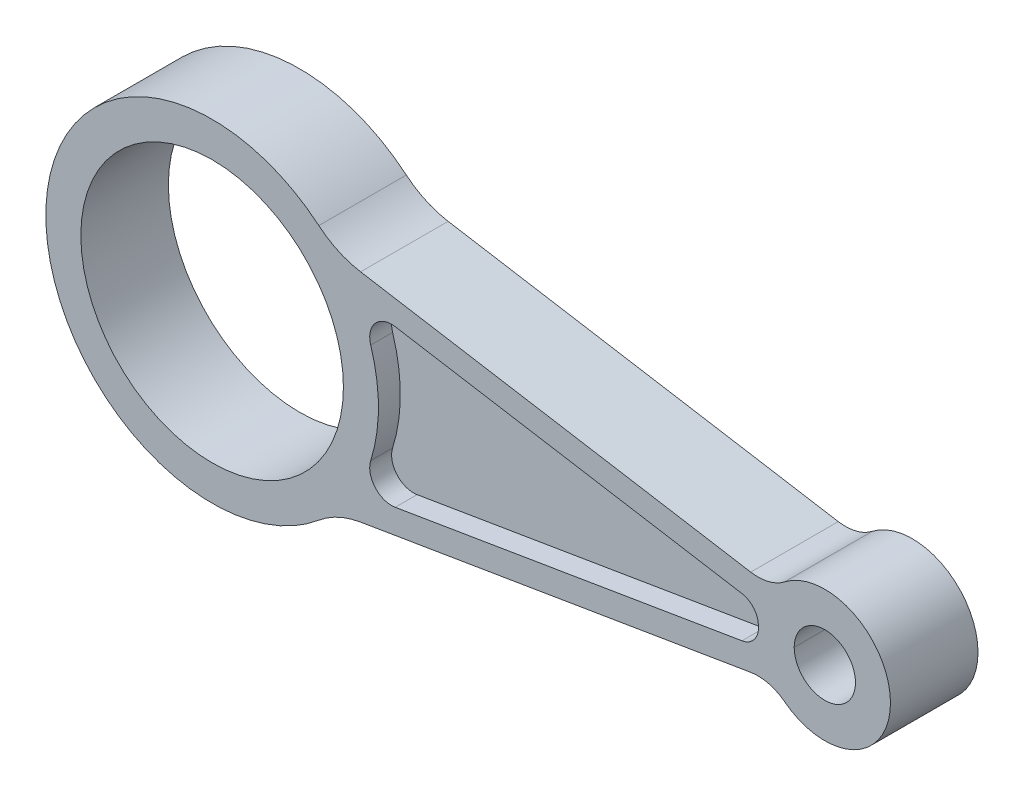
ISO-10303-21;
HEADER;
FILE_DESCRIPTION(('STEP AP214'),'2;1');
FILE_NAME('part.step','',(''),(''),'','','');
FILE_SCHEMA(('AUTOMOTIVE_DESIGN { 1 0 10303 214 1 1 1 1 }'));
ENDSEC;
DATA;
#1=APPLICATION_CONTEXT('core data for automotive mechanical design processes');
#2=APPLICATION_PROTOCOL_DEFINITION('international standard','automotive_design',2000,#1);
#3=PRODUCT_CONTEXT('',#1,'mechanical');
#4=PRODUCT('Part','Part','',(#3));
#5=PRODUCT_RELATED_PRODUCT_CATEGORY('part','',(#4));
#6=PRODUCT_DEFINITION_FORMATION('','',#4);
#7=PRODUCT_DEFINITION_CONTEXT('part definition',#1,'design');
#8=PRODUCT_DEFINITION('design','',#6,#7);
#9=PRODUCT_DEFINITION_SHAPE('','',#8);
#10=(LENGTH_UNIT() NAMED_UNIT(*) SI_UNIT(.MILLI.,.METRE.));
#11=(NAMED_UNIT(*) PLANE_ANGLE_UNIT() SI_UNIT($,.RADIAN.));
#12=(NAMED_UNIT(*) SI_UNIT($,.STERADIAN.) SOLID_ANGLE_UNIT());
#13=UNCERTAINTY_MEASURE_WITH_UNIT(LENGTH_MEASURE(1.E-05),#10,'distance_accuracy_value','');
#14=(GEOMETRIC_REPRESENTATION_CONTEXT(3) GLOBAL_UNCERTAINTY_ASSIGNED_CONTEXT((#13)) GLOBAL_UNIT_ASSIGNED_CONTEXT((#10,
#11,#12)) REPRESENTATION_CONTEXT('',''));
#15=CARTESIAN_POINT('',(0.,0.,0.));
#16=DIRECTION('',(0.,0.,1.));
#17=DIRECTION('',(1.,0.,0.));
#18=AXIS2_PLACEMENT_3D('',#15,#16,#17);
#19=CARTESIAN_POINT('',(140.,0.,-20.));
#20=DIRECTION('',(0.,0.,1.));
#21=DIRECTION('',(1.,0.,0.));
#22=AXIS2_PLACEMENT_3D('',#19,#20,#21);
#23=CYLINDRICAL_SURFACE('',#22,7.00000000000001);
#24=CARTESIAN_POINT('',(140.,0.,-20.));
#25=DIRECTION('',(0.,0.,1.));
#26=DIRECTION('',(1.,0.,0.));
#27=AXIS2_PLACEMENT_3D('',#24,#25,#26);
#28=CIRCLE('',#27,7.00000000000001);
#29=CARTESIAN_POINT('',(133.,0.,-20.));
#30=VERTEX_POINT('',#29);
#31=CARTESIAN_POINT('',(147.,0.,-20.));
#32=VERTEX_POINT('',#31);
#33=EDGE_CURVE('E328',#30,#32,#28,.T.);
#34=ORIENTED_EDGE('',*,*,#33,.F.);
#35=DIRECTION('',(0.,0.,1.));
#36=VECTOR('',#35,1.);
#37=CARTESIAN_POINT('',(133.,0.,-20.));
#38=LINE('',#37,#36);
#39=CARTESIAN_POINT('',(133.,0.,0.));
#40=VERTEX_POINT('',#39);
#41=EDGE_CURVE('E11',#30,#40,#38,.T.);
#42=ORIENTED_EDGE('',*,*,#41,.T.);
#43=CARTESIAN_POINT('',(140.,0.,0.));
#44=DIRECTION('',(0.,0.,1.));
#45=DIRECTION('',(1.,0.,0.));
#46=AXIS2_PLACEMENT_3D('',#43,#44,#45);
#47=CIRCLE('',#46,7.00000000000001);
#48=CARTESIAN_POINT('',(147.,0.,0.));
#49=VERTEX_POINT('',#48);
#50=EDGE_CURVE('E313',#40,#49,#47,.T.);
#51=ORIENTED_EDGE('',*,*,#50,.T.);
#52=DIRECTION('',(0.,0.,-1.));
#53=VECTOR('',#52,1.);
#54=CARTESIAN_POINT('',(147.,0.,-20.));
#55=LINE('',#54,#53);
#56=EDGE_CURVE('E51',#49,#32,#55,.T.);
#57=ORIENTED_EDGE('',*,*,#56,.T.);
#58=EDGE_LOOP('',(#34,#42,#51,#57));
#59=FACE_BOUND('',#58,.T.);
#60=ADVANCED_FACE('F42',(#59),#23,.F.);
#61=CARTESIAN_POINT('',(0.,0.,-20.));
#62=DIRECTION('',(0.,0.,1.));
#63=DIRECTION('',(1.,0.,0.));
#64=AXIS2_PLACEMENT_3D('',#61,#62,#63);
#65=CYLINDRICAL_SURFACE('',#64,38.);
#66=CARTESIAN_POINT('',(0.,0.,0.));
#67=DIRECTION('',(0.,0.,1.));
#68=DIRECTION('',(1.,0.,0.));
#69=AXIS2_PLACEMENT_3D('',#66,#67,#68);
#70=CIRCLE('',#69,38.);
#71=CARTESIAN_POINT('',(24.3781675337846,29.1496989297442,0.));
#72=VERTEX_POINT('',#71);
#73=CARTESIAN_POINT('',(24.3781675337846,-29.1496989297442,0.));
#74=VERTEX_POINT('',#73);
#75=EDGE_CURVE('E338',#72,#74,#70,.T.);
#76=ORIENTED_EDGE('',*,*,#75,.F.);
#77=DIRECTION('',(0.,0.,1.));
#78=VECTOR('',#77,1.);
#79=CARTESIAN_POINT('',(24.3781675337846,29.1496989297442,-20.));
#80=LINE('',#79,#78);
#81=CARTESIAN_POINT('',(24.3781675337846,29.1496989297442,-20.));
#82=VERTEX_POINT('',#81);
#83=EDGE_CURVE('E385',#72,#82,#80,.F.);
#84=ORIENTED_EDGE('',*,*,#83,.T.);
#85=CARTESIAN_POINT('',(0.,0.,-20.));
#86=DIRECTION('',(0.,0.,1.));
#87=DIRECTION('',(1.,0.,0.));
#88=AXIS2_PLACEMENT_3D('',#85,#86,#87);
#89=CIRCLE('',#88,38.);
#90=CARTESIAN_POINT('',(24.3781675337846,-29.1496989297442,-20.));
#91=VERTEX_POINT('',#90);
#92=EDGE_CURVE('E349',#82,#91,#89,.T.);
#93=ORIENTED_EDGE('',*,*,#92,.T.);
#94=DIRECTION('',(0.,0.,1.));
#95=VECTOR('',#94,1.);
#96=CARTESIAN_POINT('',(24.3781675337846,-29.1496989297442,-20.));
#97=LINE('',#96,#95);
#98=EDGE_CURVE('E382',#91,#74,#97,.T.);
#99=ORIENTED_EDGE('',*,*,#98,.T.);
#100=EDGE_LOOP('',(#76,#84,#93,#99));
#101=FACE_BOUND('',#100,.T.);
#102=ADVANCED_FACE('F44',(#101),#65,.T.);
#103=CARTESIAN_POINT('',(27.9354736759495,25.7606154914888,-20.));
#104=DIRECTION('',(0.164285714285714,0.986412795984335,0.));
#105=DIRECTION('',(-0.986412795984335,0.164285714285714,0.));
#106=AXIS2_PLACEMENT_3D('',#103,#104,#105);
#107=PLANE('',#106);
#108=DIRECTION('',(-0.986412795984335,0.164285714285714,0.));
#109=VECTOR('',#108,1.);
#110=CARTESIAN_POINT('',(27.9354736759495,25.7606154914888,-20.));
#111=LINE('',#110,#109);
#112=CARTESIAN_POINT('',(123.068754783715,9.91629645714704,-20.));
#113=VERTEX_POINT('',#112);
#114=CARTESIAN_POINT('',(33.9230677395358,24.7633898151861,-20.));
#115=VERTEX_POINT('',#114);
#116=EDGE_CURVE('E357',#113,#115,#111,.T.);
#117=ORIENTED_EDGE('',*,*,#116,.T.);
#118=DIRECTION('',(0.,0.,-1.));
#119=VECTOR('',#118,1.);
#120=CARTESIAN_POINT('',(33.9230677395358,24.7633898151861,0.));
#121=LINE('',#120,#119);
#122=CARTESIAN_POINT('',(33.9230677395358,24.7633898151861,0.));
#123=VERTEX_POINT('',#122);
#124=EDGE_CURVE('E379',#115,#123,#121,.F.);
#125=ORIENTED_EDGE('',*,*,#124,.T.);
#126=DIRECTION('',(-0.986412795984335,0.164285714285714,0.));
#127=VECTOR('',#126,1.);
#128=CARTESIAN_POINT('',(27.9354736759495,25.7606154914888,0.));
#129=LINE('',#128,#127);
#130=CARTESIAN_POINT('',(123.068754783715,9.91629645714704,0.));
#131=VERTEX_POINT('',#130);
#132=EDGE_CURVE('E346',#131,#123,#129,.T.);
#133=ORIENTED_EDGE('',*,*,#132,.F.);
#134=DIRECTION('',(0.,0.,-1.));
#135=VECTOR('',#134,1.);
#136=CARTESIAN_POINT('',(123.068754783715,9.91629645714704,-20.));
#137=LINE('',#136,#135);
#138=EDGE_CURVE('E365',#131,#113,#137,.T.);
#139=ORIENTED_EDGE('',*,*,#138,.T.);
#140=EDGE_LOOP('',(#117,#125,#133,#139));
#141=FACE_BOUND('',#140,.T.);
#142=ADVANCED_FACE('F423',(#141),#107,.T.);
#143=CARTESIAN_POINT('',(140.,0.,-20.));
#144=DIRECTION('',(0.,0.,1.));
#145=DIRECTION('',(1.,0.,0.));
#146=AXIS2_PLACEMENT_3D('',#143,#144,#145);
#147=CYLINDRICAL_SURFACE('',#146,15.);
#148=CARTESIAN_POINT('',(140.,0.,-20.));
#149=DIRECTION('',(0.,0.,1.));
#150=DIRECTION('',(1.,0.,0.));
#151=AXIS2_PLACEMENT_3D('',#148,#149,#150);
#152=CIRCLE('',#151,15.);
#153=CARTESIAN_POINT('',(130.826967155943,-11.8682546501942,-20.));
#154=VERTEX_POINT('',#153);
#155=CARTESIAN_POINT('',(130.826967155943,11.8682546501942,-20.));
#156=VERTEX_POINT('',#155);
#157=EDGE_CURVE('E354',#154,#156,#152,.T.);
#158=ORIENTED_EDGE('',*,*,#157,.T.);
#159=DIRECTION('',(0.,0.,1.));
#160=VECTOR('',#159,1.);
#161=CARTESIAN_POINT('',(130.826967155943,11.8682546501942,-20.));
#162=LINE('',#161,#160);
#163=CARTESIAN_POINT('',(130.826967155943,11.8682546501942,0.));
#164=VERTEX_POINT('',#163);
#165=EDGE_CURVE('E362',#156,#164,#162,.T.);
#166=ORIENTED_EDGE('',*,*,#165,.T.);
#167=CARTESIAN_POINT('',(140.,0.,0.));
#168=DIRECTION('',(0.,0.,1.));
#169=DIRECTION('',(1.,0.,0.));
#170=AXIS2_PLACEMENT_3D('',#167,#168,#169);
#171=CIRCLE('',#170,15.);
#172=CARTESIAN_POINT('',(130.826967155943,-11.8682546501942,0.));
#173=VERTEX_POINT('',#172);
#174=EDGE_CURVE('E343',#173,#164,#171,.T.);
#175=ORIENTED_EDGE('',*,*,#174,.F.);
#176=DIRECTION('',(0.,0.,1.));
#177=VECTOR('',#176,1.);
#178=CARTESIAN_POINT('',(130.826967155943,-11.8682546501942,-20.));
#179=LINE('',#178,#177);
#180=EDGE_CURVE('E360',#173,#154,#179,.F.);
#181=ORIENTED_EDGE('',*,*,#180,.T.);
#182=EDGE_LOOP('',(#158,#166,#175,#181));
#183=FACE_BOUND('',#182,.T.);
#184=ADVANCED_FACE('F433',(#183),#147,.T.);
#185=CARTESIAN_POINT('',(27.9354736759495,-25.7606154914888,-20.));
#186=DIRECTION('',(0.164285714285714,-0.986412795984335,0.));
#187=DIRECTION('',(0.986412795984335,0.164285714285714,0.));
#188=AXIS2_PLACEMENT_3D('',#185,#186,#187);
#189=PLANE('',#188);
#190=DIRECTION('',(0.986412795984335,0.164285714285714,0.));
#191=VECTOR('',#190,1.);
#192=CARTESIAN_POINT('',(27.9354736759495,-25.7606154914888,0.));
#193=LINE('',#192,#191);
#194=CARTESIAN_POINT('',(33.9230677395358,-24.7633898151861,0.));
#195=VERTEX_POINT('',#194);
#196=CARTESIAN_POINT('',(123.068754783715,-9.91629645714704,0.));
#197=VERTEX_POINT('',#196);
#198=EDGE_CURVE('E341',#195,#197,#193,.T.);
#199=ORIENTED_EDGE('',*,*,#198,.F.);
#200=DIRECTION('',(0.,0.,-1.));
#201=VECTOR('',#200,1.);
#202=CARTESIAN_POINT('',(33.9230677395358,-24.7633898151861,-20.));
#203=LINE('',#202,#201);
#204=CARTESIAN_POINT('',(33.9230677395358,-24.7633898151861,-20.));
#205=VERTEX_POINT('',#204);
#206=EDGE_CURVE('E387',#195,#205,#203,.T.);
#207=ORIENTED_EDGE('',*,*,#206,.T.);
#208=DIRECTION('',(0.986412795984335,0.164285714285714,0.));
#209=VECTOR('',#208,1.);
#210=CARTESIAN_POINT('',(27.9354736759495,-25.7606154914888,-20.));
#211=LINE('',#210,#209);
#212=CARTESIAN_POINT('',(123.068754783715,-9.91629645714704,-20.));
#213=VERTEX_POINT('',#212);
#214=EDGE_CURVE('E352',#205,#213,#211,.T.);
#215=ORIENTED_EDGE('',*,*,#214,.T.);
#216=DIRECTION('',(0.,0.,-1.));
#217=VECTOR('',#216,1.);
#218=CARTESIAN_POINT('',(123.068754783715,-9.91629645714704,0.));
#219=LINE('',#218,#217);
#220=EDGE_CURVE('E367',#213,#197,#219,.F.);
#221=ORIENTED_EDGE('',*,*,#220,.T.);
#222=EDGE_LOOP('',(#199,#207,#215,#221));
#223=FACE_BOUND('',#222,.T.);
#224=ADVANCED_FACE('F406',(#223),#189,.T.);
#225=CARTESIAN_POINT('',(0.,0.,-20.));
#226=DIRECTION('',(0.,0.,1.));
#227=DIRECTION('',(1.,0.,0.));
#228=AXIS2_PLACEMENT_3D('',#225,#226,#227);
#229=PLANE('',#228);
#230=DIRECTION('',(0.986412795984335,-0.164285714285714,0.));
#231=VECTOR('',#230,1.);
#232=CARTESIAN_POINT('',(121.445609230919,4.61087017438385,-20.));
#233=LINE('',#232,#231);
#234=CARTESIAN_POINT('',(41.8285545583335,17.8709827250915,-20.));
#235=VERTEX_POINT('',#234);
#236=CARTESIAN_POINT('',(121.445609230919,4.61087017438385,-20.));
#237=VERTEX_POINT('',#236);
#238=EDGE_CURVE('E217',#235,#237,#233,.T.);
#239=ORIENTED_EDGE('',*,*,#238,.F.);
#240=CARTESIAN_POINT('',(41.0071259869049,12.9389187451698,-20.));
#241=DIRECTION('',(0.,0.,-1.));
#242=DIRECTION('',(1.,0.,0.));
#243=AXIS2_PLACEMENT_3D('',#240,#241,#242);
#244=CIRCLE('',#243,5.);
#245=CARTESIAN_POINT('',(36.2388555233113,11.4343933096849,-20.));
#246=VERTEX_POINT('',#245);
#247=EDGE_CURVE('E221',#246,#235,#244,.T.);
#248=ORIENTED_EDGE('',*,*,#247,.F.);
#249=CARTESIAN_POINT('',(0.,0.,-20.));
#250=DIRECTION('',(0.,0.,1.));
#251=DIRECTION('',(-1.,0.,0.));
#252=AXIS2_PLACEMENT_3D('',#249,#250,#251);
#253=CIRCLE('',#252,38.);
#254=CARTESIAN_POINT('',(36.2388555233113,-11.4343933096849,-20.));
#255=VERTEX_POINT('',#254);
#256=EDGE_CURVE('E238',#255,#246,#253,.T.);
#257=ORIENTED_EDGE('',*,*,#256,.F.);
#258=CARTESIAN_POINT('',(41.0071259869049,-12.9389187451698,-20.));
#259=DIRECTION('',(0.,0.,-1.));
#260=DIRECTION('',(-1.,0.,0.));
#261=AXIS2_PLACEMENT_3D('',#258,#259,#260);
#262=CIRCLE('',#261,5.);
#263=CARTESIAN_POINT('',(41.8285545583335,-17.8709827250915,-20.));
#264=VERTEX_POINT('',#263);
#265=EDGE_CURVE('E235',#264,#255,#262,.T.);
#266=ORIENTED_EDGE('',*,*,#265,.F.);
#267=DIRECTION('',(-0.986412795984335,-0.164285714285714,0.));
#268=VECTOR('',#267,1.);
#269=CARTESIAN_POINT('',(121.433526351168,-4.61288256163042,-20.));
#270=LINE('',#269,#268);
#271=CARTESIAN_POINT('',(121.433526351168,-4.61288256163042,-20.));
#272=VERTEX_POINT('',#271);
#273=EDGE_CURVE('E229',#272,#264,#270,.T.);
#274=ORIENTED_EDGE('',*,*,#273,.F.);
#275=CARTESIAN_POINT('',(120.694240636883,-0.174024979700915,-20.));
#276=DIRECTION('',(0.,0.,-1.));
#277=DIRECTION('',(-1.,0.,0.));
#278=AXIS2_PLACEMENT_3D('',#275,#276,#277);
#279=CIRCLE('',#278,4.5);
#280=CARTESIAN_POINT('',(125.194211833788,-0.157924451151643,-20.));
#281=VERTEX_POINT('',#280);
#282=EDGE_CURVE('E227',#281,#272,#279,.T.);
#283=ORIENTED_EDGE('',*,*,#282,.F.);
#284=CARTESIAN_POINT('',(120.706323516633,0.172012592454348,-20.));
#285=DIRECTION('',(0.,0.,-1.));
#286=DIRECTION('',(1.,0.,0.));
#287=AXIS2_PLACEMENT_3D('',#284,#285,#286);
#288=CIRCLE('',#287,4.5);
#289=EDGE_CURVE('E205',#237,#281,#288,.T.);
#290=ORIENTED_EDGE('',*,*,#289,.F.);
#291=EDGE_LOOP('',(#239,#248,#257,#266,#274,#283,#290));
#292=FACE_BOUND('',#291,.T.);
#293=EDGE_CURVE('E329',#32,#30,#28,.T.);
#294=ORIENTED_EDGE('',*,*,#293,.T.);
#295=ORIENTED_EDGE('',*,*,#33,.T.);
#296=EDGE_LOOP('',(#294,#295));
#297=FACE_BOUND('',#296,.T.);
#298=CARTESIAN_POINT('',(0.,0.,-20.));
#299=DIRECTION('',(0.,0.,1.));
#300=DIRECTION('',(1.,0.,0.));
#301=AXIS2_PLACEMENT_3D('',#298,#299,#300);
#302=CIRCLE('',#301,30.);
#303=CARTESIAN_POINT('',(30.,0.,-20.));
#304=VERTEX_POINT('',#303);
#305=EDGE_CURVE('E335',#304,#304,#302,.T.);
#306=ORIENTED_EDGE('',*,*,#305,.T.);
#307=EDGE_LOOP('',(#306));
#308=FACE_BOUND('',#307,.T.);
#309=ORIENTED_EDGE('',*,*,#92,.F.);
#310=CARTESIAN_POINT('',(37.2087820252501,44.4916457348728,-20.));
#311=DIRECTION('',(0.,0.,1.));
#312=DIRECTION('',(1.,0.,0.));
#313=AXIS2_PLACEMENT_3D('',#310,#311,#312);
#314=CIRCLE('',#313,20.);
#315=EDGE_CURVE('E391',#82,#115,#314,.T.);
#316=ORIENTED_EDGE('',*,*,#315,.T.);
#317=ORIENTED_EDGE('',*,*,#116,.F.);
#318=CARTESIAN_POINT('',(124.711611926572,19.7804244169904,-20.));
#319=DIRECTION('',(0.,0.,1.));
#320=DIRECTION('',(1.,0.,0.));
#321=AXIS2_PLACEMENT_3D('',#318,#319,#320);
#322=CIRCLE('',#321,10.);
#323=EDGE_CURVE('E372',#113,#156,#322,.T.);
#324=ORIENTED_EDGE('',*,*,#323,.T.);
#325=ORIENTED_EDGE('',*,*,#157,.F.);
#326=CARTESIAN_POINT('',(124.711611926572,-19.7804244169904,-20.));
#327=DIRECTION('',(0.,0.,1.));
#328=DIRECTION('',(1.,0.,0.));
#329=AXIS2_PLACEMENT_3D('',#326,#327,#328);
#330=CIRCLE('',#329,10.);
#331=EDGE_CURVE('E376',#154,#213,#330,.T.);
#332=ORIENTED_EDGE('',*,*,#331,.T.);
#333=ORIENTED_EDGE('',*,*,#214,.F.);
#334=CARTESIAN_POINT('',(37.2087820252501,-44.4916457348728,-20.));
#335=DIRECTION('',(0.,0.,1.));
#336=DIRECTION('',(1.,0.,0.));
#337=AXIS2_PLACEMENT_3D('',#334,#335,#336);
#338=CIRCLE('',#337,20.);
#339=EDGE_CURVE('E395',#205,#91,#338,.T.);
#340=ORIENTED_EDGE('',*,*,#339,.T.);
#341=EDGE_LOOP('',(#309,#316,#317,#324,#325,#332,#333,#340));
#342=FACE_BOUND('',#341,.T.);
#343=ADVANCED_FACE('F223',(#292,#297,#308,#342),#229,.F.);
#344=CARTESIAN_POINT('',(0.,0.,0.));
#345=DIRECTION('',(0.,0.,1.));
#346=DIRECTION('',(1.,0.,0.));
#347=AXIS2_PLACEMENT_3D('',#344,#345,#346);
#348=PLANE('',#347);
#349=CARTESIAN_POINT('',(41.0071259869049,12.9389187451698,0.));
#350=DIRECTION('',(0.,0.,1.));
#351=DIRECTION('',(-1.,0.,0.));
#352=AXIS2_PLACEMENT_3D('',#349,#350,#351);
#353=CIRCLE('',#352,5.);
#354=CARTESIAN_POINT('',(41.8285545583335,17.8709827250915,0.));
#355=VERTEX_POINT('',#354);
#356=CARTESIAN_POINT('',(36.2388555233113,11.4343933096849,0.));
#357=VERTEX_POINT('',#356);
#358=EDGE_CURVE('E261',#355,#357,#353,.T.);
#359=ORIENTED_EDGE('',*,*,#358,.F.);
#360=DIRECTION('',(-0.986412795984335,0.164285714285714,0.));
#361=VECTOR('',#360,1.);
#362=CARTESIAN_POINT('',(41.8285545583335,17.8709827250915,0.));
#363=LINE('',#362,#361);
#364=CARTESIAN_POINT('',(121.046940727538,4.67726787330641,0.));
#365=VERTEX_POINT('',#364);
#366=EDGE_CURVE('E286',#365,#355,#363,.T.);
#367=ORIENTED_EDGE('',*,*,#366,.F.);
#368=CARTESIAN_POINT('',(120.307655013253,0.238410291376902,0.));
#369=DIRECTION('',(0.,0.,1.));
#370=DIRECTION('',(1.,0.,0.));
#371=AXIS2_PLACEMENT_3D('',#368,#369,#370);
#372=CIRCLE('',#371,4.5);
#373=CARTESIAN_POINT('',(124.807655013251,0.238406077182834,0.));
#374=VERTEX_POINT('',#373);
#375=EDGE_CURVE('E283',#374,#365,#372,.T.);
#376=ORIENTED_EDGE('',*,*,#375,.F.);
#377=CARTESIAN_POINT('',(120.332548017383,-0.234264395276501,0.));
#378=DIRECTION('',(0.,0.,1.));
#379=DIRECTION('',(-1.,0.,0.));
#380=AXIS2_PLACEMENT_3D('',#377,#378,#379);
#381=CIRCLE('',#380,4.5);
#382=CARTESIAN_POINT('',(121.071833731668,-4.67312197720601,0.));
#383=VERTEX_POINT('',#382);
#384=EDGE_CURVE('E280',#383,#374,#381,.T.);
#385=ORIENTED_EDGE('',*,*,#384,.F.);
#386=DIRECTION('',(0.986412795984335,0.164285714285714,0.));
#387=VECTOR('',#386,1.);
#388=CARTESIAN_POINT('',(41.8285545583335,-17.8709827250915,0.));
#389=LINE('',#388,#387);
#390=CARTESIAN_POINT('',(41.8285545583335,-17.8709827250915,0.));
#391=VERTEX_POINT('',#390);
#392=EDGE_CURVE('E277',#391,#383,#389,.T.);
#393=ORIENTED_EDGE('',*,*,#392,.F.);
#394=CARTESIAN_POINT('',(41.0071259869049,-12.9389187451698,0.));
#395=DIRECTION('',(0.,0.,1.));
#396=DIRECTION('',(-1.,0.,0.));
#397=AXIS2_PLACEMENT_3D('',#394,#395,#396);
#398=CIRCLE('',#397,5.);
#399=CARTESIAN_POINT('',(36.2388555233113,-11.4343933096849,0.));
#400=VERTEX_POINT('',#399);
#401=EDGE_CURVE('E274',#400,#391,#398,.T.);
#402=ORIENTED_EDGE('',*,*,#401,.F.);
#403=CARTESIAN_POINT('',(0.,0.,0.));
#404=DIRECTION('',(0.,0.,-1.));
#405=DIRECTION('',(1.,0.,0.));
#406=AXIS2_PLACEMENT_3D('',#403,#404,#405);
#407=CIRCLE('',#406,38.);
#408=EDGE_CURVE('E271',#357,#400,#407,.T.);
#409=ORIENTED_EDGE('',*,*,#408,.F.);
#410=EDGE_LOOP('',(#359,#367,#376,#385,#393,#402,#409));
#411=FACE_BOUND('',#410,.T.);
#412=EDGE_CURVE('E326',#49,#40,#47,.T.);
#413=ORIENTED_EDGE('',*,*,#412,.F.);
#414=ORIENTED_EDGE('',*,*,#50,.F.);
#415=EDGE_LOOP('',(#413,#414));
#416=FACE_BOUND('',#415,.T.);
#417=CARTESIAN_POINT('',(0.,0.,0.));
#418=DIRECTION('',(0.,0.,1.));
#419=DIRECTION('',(1.,0.,0.));
#420=AXIS2_PLACEMENT_3D('',#417,#418,#419);
#421=CIRCLE('',#420,30.);
#422=CARTESIAN_POINT('',(30.,0.,0.));
#423=VERTEX_POINT('',#422);
#424=EDGE_CURVE('E332',#423,#423,#421,.T.);
#425=ORIENTED_EDGE('',*,*,#424,.F.);
#426=EDGE_LOOP('',(#425));
#427=FACE_BOUND('',#426,.T.);
#428=ORIENTED_EDGE('',*,*,#132,.T.);
#429=CARTESIAN_POINT('',(37.2087820252501,44.4916457348728,0.));
#430=DIRECTION('',(0.,0.,1.));
#431=DIRECTION('',(1.,0.,0.));
#432=AXIS2_PLACEMENT_3D('',#429,#430,#431);
#433=CIRCLE('',#432,20.);
#434=EDGE_CURVE('E389',#123,#72,#433,.F.);
#435=ORIENTED_EDGE('',*,*,#434,.T.);
#436=ORIENTED_EDGE('',*,*,#75,.T.);
#437=CARTESIAN_POINT('',(37.2087820252501,-44.4916457348728,0.));
#438=DIRECTION('',(0.,0.,1.));
#439=DIRECTION('',(1.,0.,0.));
#440=AXIS2_PLACEMENT_3D('',#437,#438,#439);
#441=CIRCLE('',#440,20.);
#442=EDGE_CURVE('E393',#74,#195,#441,.F.);
#443=ORIENTED_EDGE('',*,*,#442,.T.);
#444=ORIENTED_EDGE('',*,*,#198,.T.);
#445=CARTESIAN_POINT('',(124.711611926572,-19.7804244169904,0.));
#446=DIRECTION('',(0.,0.,1.));
#447=DIRECTION('',(1.,0.,0.));
#448=AXIS2_PLACEMENT_3D('',#445,#446,#447);
#449=CIRCLE('',#448,10.);
#450=EDGE_CURVE('E374',#197,#173,#449,.F.);
#451=ORIENTED_EDGE('',*,*,#450,.T.);
#452=ORIENTED_EDGE('',*,*,#174,.T.);
#453=CARTESIAN_POINT('',(124.711611926572,19.7804244169904,0.));
#454=DIRECTION('',(0.,0.,1.));
#455=DIRECTION('',(1.,0.,0.));
#456=AXIS2_PLACEMENT_3D('',#453,#454,#455);
#457=CIRCLE('',#456,10.);
#458=EDGE_CURVE('E370',#164,#131,#457,.F.);
#459=ORIENTED_EDGE('',*,*,#458,.T.);
#460=EDGE_LOOP('',(#428,#435,#436,#443,#444,#451,#452,#459));
#461=FACE_BOUND('',#460,.T.);
#462=ADVANCED_FACE('F405',(#411,#416,#427,#461),#348,.T.);
#463=CARTESIAN_POINT('',(0.,0.,-20.));
#464=DIRECTION('',(0.,0.,1.));
#465=DIRECTION('',(1.,0.,0.));
#466=AXIS2_PLACEMENT_3D('',#463,#464,#465);
#467=CYLINDRICAL_SURFACE('',#466,30.);
#468=ORIENTED_EDGE('',*,*,#305,.F.);
#469=EDGE_LOOP('',(#468));
#470=FACE_BOUND('',#469,.T.);
#471=ORIENTED_EDGE('',*,*,#424,.T.);
#472=EDGE_LOOP('',(#471));
#473=FACE_BOUND('',#472,.T.);
#474=ADVANCED_FACE('F458',(#470,#473),#467,.F.);
#475=ORIENTED_EDGE('',*,*,#41,.F.);
#476=ORIENTED_EDGE('',*,*,#293,.F.);
#477=ORIENTED_EDGE('',*,*,#56,.F.);
#478=ORIENTED_EDGE('',*,*,#412,.T.);
#479=EDGE_LOOP('',(#475,#476,#477,#478));
#480=FACE_BOUND('',#479,.T.);
#481=ADVANCED_FACE('F402',(#480),#23,.F.);
#482=CARTESIAN_POINT('',(124.711611926572,19.7804244169904,-20.));
#483=DIRECTION('',(0.,0.,1.));
#484=DIRECTION('',(1.,0.,0.));
#485=AXIS2_PLACEMENT_3D('',#482,#483,#484);
#486=CYLINDRICAL_SURFACE('',#485,10.);
#487=ORIENTED_EDGE('',*,*,#323,.F.);
#488=ORIENTED_EDGE('',*,*,#138,.F.);
#489=ORIENTED_EDGE('',*,*,#458,.F.);
#490=ORIENTED_EDGE('',*,*,#165,.F.);
#491=EDGE_LOOP('',(#487,#488,#489,#490));
#492=FACE_BOUND('',#491,.T.);
#493=ADVANCED_FACE('F431',(#492),#486,.F.);
#494=CARTESIAN_POINT('',(124.711611926572,-19.7804244169904,-20.));
#495=DIRECTION('',(0.,0.,1.));
#496=DIRECTION('',(1.,0.,0.));
#497=AXIS2_PLACEMENT_3D('',#494,#495,#496);
#498=CYLINDRICAL_SURFACE('',#497,10.);
#499=ORIENTED_EDGE('',*,*,#331,.F.);
#500=ORIENTED_EDGE('',*,*,#180,.F.);
#501=ORIENTED_EDGE('',*,*,#450,.F.);
#502=ORIENTED_EDGE('',*,*,#220,.F.);
#503=EDGE_LOOP('',(#499,#500,#501,#502));
#504=FACE_BOUND('',#503,.T.);
#505=ADVANCED_FACE('F439',(#504),#498,.F.);
#506=CARTESIAN_POINT('',(37.2087820252501,44.4916457348728,-20.));
#507=DIRECTION('',(0.,0.,1.));
#508=DIRECTION('',(1.,0.,0.));
#509=AXIS2_PLACEMENT_3D('',#506,#507,#508);
#510=CYLINDRICAL_SURFACE('',#509,20.);
#511=ORIENTED_EDGE('',*,*,#315,.F.);
#512=ORIENTED_EDGE('',*,*,#83,.F.);
#513=ORIENTED_EDGE('',*,*,#434,.F.);
#514=ORIENTED_EDGE('',*,*,#124,.F.);
#515=EDGE_LOOP('',(#511,#512,#513,#514));
#516=FACE_BOUND('',#515,.T.);
#517=ADVANCED_FACE('F420',(#516),#510,.F.);
#518=CARTESIAN_POINT('',(37.2087820252501,-44.4916457348728,-20.));
#519=DIRECTION('',(0.,0.,1.));
#520=DIRECTION('',(1.,0.,0.));
#521=AXIS2_PLACEMENT_3D('',#518,#519,#520);
#522=CYLINDRICAL_SURFACE('',#521,20.);
#523=ORIENTED_EDGE('',*,*,#339,.F.);
#524=ORIENTED_EDGE('',*,*,#206,.F.);
#525=ORIENTED_EDGE('',*,*,#442,.F.);
#526=ORIENTED_EDGE('',*,*,#98,.F.);
#527=EDGE_LOOP('',(#523,#524,#525,#526));
#528=FACE_BOUND('',#527,.T.);
#529=ADVANCED_FACE('F445',(#528),#522,.F.);
#530=CARTESIAN_POINT('',(41.0071259869049,12.9389187451698,-5.));
#531=DIRECTION('',(0.,0.,1.));
#532=DIRECTION('',(1.,0.,0.));
#533=AXIS2_PLACEMENT_3D('',#530,#531,#532);
#534=CYLINDRICAL_SURFACE('',#533,5.);
#535=ORIENTED_EDGE('',*,*,#358,.T.);
#536=DIRECTION('',(0.,0.,1.));
#537=VECTOR('',#536,1.);
#538=CARTESIAN_POINT('',(36.2388555233113,11.4343933096849,-5.));
#539=LINE('',#538,#537);
#540=CARTESIAN_POINT('',(36.2388555233113,11.4343933096849,-5.));
#541=VERTEX_POINT('',#540);
#542=EDGE_CURVE('E310',#541,#357,#539,.T.);
#543=ORIENTED_EDGE('',*,*,#542,.F.);
#544=CARTESIAN_POINT('',(41.0071259869049,12.9389187451698,-5.));
#545=DIRECTION('',(0.,0.,1.));
#546=DIRECTION('',(-1.,0.,0.));
#547=AXIS2_PLACEMENT_3D('',#544,#545,#546);
#548=CIRCLE('',#547,5.);
#549=CARTESIAN_POINT('',(41.8285545583335,17.8709827250915,-5.));
#550=VERTEX_POINT('',#549);
#551=EDGE_CURVE('E289',#550,#541,#548,.T.);
#552=ORIENTED_EDGE('',*,*,#551,.F.);
#553=DIRECTION('',(0.,0.,1.));
#554=VECTOR('',#553,1.);
#555=CARTESIAN_POINT('',(41.8285545583335,17.8709827250915,-5.));
#556=LINE('',#555,#554);
#557=EDGE_CURVE('E311',#550,#355,#556,.T.);
#558=ORIENTED_EDGE('',*,*,#557,.T.);
#559=EDGE_LOOP('',(#535,#543,#552,#558));
#560=FACE_BOUND('',#559,.T.);
#561=ADVANCED_FACE('F526',(#560),#534,.F.);
#562=CARTESIAN_POINT('',(41.8285545583335,17.8709827250915,-5.));
#563=DIRECTION('',(0.164285714285714,0.986412795984335,0.));
#564=DIRECTION('',(-0.986412795984335,0.164285714285714,0.));
#565=AXIS2_PLACEMENT_3D('',#562,#563,#564);
#566=PLANE('',#565);
#567=ORIENTED_EDGE('',*,*,#366,.T.);
#568=ORIENTED_EDGE('',*,*,#557,.F.);
#569=DIRECTION('',(-0.986412795984335,0.164285714285714,0.));
#570=VECTOR('',#569,1.);
#571=CARTESIAN_POINT('',(41.8285545583335,17.8709827250915,-5.));
#572=LINE('',#571,#570);
#573=CARTESIAN_POINT('',(121.046940727538,4.67726787330641,-5.));
#574=VERTEX_POINT('',#573);
#575=EDGE_CURVE('E307',#574,#550,#572,.T.);
#576=ORIENTED_EDGE('',*,*,#575,.F.);
#577=DIRECTION('',(0.,0.,1.));
#578=VECTOR('',#577,1.);
#579=CARTESIAN_POINT('',(121.046940727538,4.67726787330641,-5.));
#580=LINE('',#579,#578);
#581=EDGE_CURVE('E314',#574,#365,#580,.T.);
#582=ORIENTED_EDGE('',*,*,#581,.T.);
#583=EDGE_LOOP('',(#567,#568,#576,#582));
#584=FACE_BOUND('',#583,.T.);
#585=ADVANCED_FACE('F535',(#584),#566,.F.);
#586=CARTESIAN_POINT('',(120.307655013253,0.238410291376902,-5.));
#587=DIRECTION('',(0.,0.,1.));
#588=DIRECTION('',(1.,0.,0.));
#589=AXIS2_PLACEMENT_3D('',#586,#587,#588);
#590=CYLINDRICAL_SURFACE('',#589,4.5);
#591=ORIENTED_EDGE('',*,*,#375,.T.);
#592=ORIENTED_EDGE('',*,*,#581,.F.);
#593=CARTESIAN_POINT('',(120.307655013253,0.238410291376902,-5.));
#594=DIRECTION('',(0.,0.,1.));
#595=DIRECTION('',(1.,0.,0.));
#596=AXIS2_PLACEMENT_3D('',#593,#594,#595);
#597=CIRCLE('',#596,4.5);
#598=CARTESIAN_POINT('',(124.807655013251,0.238406077182834,-5.));
#599=VERTEX_POINT('',#598);
#600=EDGE_CURVE('E304',#599,#574,#597,.T.);
#601=ORIENTED_EDGE('',*,*,#600,.F.);
#602=DIRECTION('',(0.,0.,1.));
#603=VECTOR('',#602,1.);
#604=CARTESIAN_POINT('',(124.807655013251,0.238406077182834,-5.));
#605=LINE('',#604,#603);
#606=EDGE_CURVE('E316',#599,#374,#605,.T.);
#607=ORIENTED_EDGE('',*,*,#606,.T.);
#608=EDGE_LOOP('',(#591,#592,#601,#607));
#609=FACE_BOUND('',#608,.T.);
#610=ADVANCED_FACE('F545',(#609),#590,.F.);
#611=CARTESIAN_POINT('',(120.332548017383,-0.234264395276501,-5.));
#612=DIRECTION('',(0.,0.,1.));
#613=DIRECTION('',(1.,0.,0.));
#614=AXIS2_PLACEMENT_3D('',#611,#612,#613);
#615=CYLINDRICAL_SURFACE('',#614,4.5);
#616=ORIENTED_EDGE('',*,*,#384,.T.);
#617=ORIENTED_EDGE('',*,*,#606,.F.);
#618=CARTESIAN_POINT('',(120.332548017383,-0.234264395276501,-5.));
#619=DIRECTION('',(0.,0.,1.));
#620=DIRECTION('',(-1.,0.,0.));
#621=AXIS2_PLACEMENT_3D('',#618,#619,#620);
#622=CIRCLE('',#621,4.5);
#623=CARTESIAN_POINT('',(121.071833731668,-4.67312197720601,-5.));
#624=VERTEX_POINT('',#623);
#625=EDGE_CURVE('E301',#624,#599,#622,.T.);
#626=ORIENTED_EDGE('',*,*,#625,.F.);
#627=DIRECTION('',(0.,0.,1.));
#628=VECTOR('',#627,1.);
#629=CARTESIAN_POINT('',(121.071833731668,-4.67312197720601,-5.));
#630=LINE('',#629,#628);
#631=EDGE_CURVE('E318',#624,#383,#630,.T.);
#632=ORIENTED_EDGE('',*,*,#631,.T.);
#633=EDGE_LOOP('',(#616,#617,#626,#632));
#634=FACE_BOUND('',#633,.T.);
#635=ADVANCED_FACE('F555',(#634),#615,.F.);
#636=CARTESIAN_POINT('',(41.8285545583335,-17.8709827250915,-5.));
#637=DIRECTION('',(0.164285714285714,-0.986412795984335,0.));
#638=DIRECTION('',(0.986412795984335,0.164285714285714,0.));
#639=AXIS2_PLACEMENT_3D('',#636,#637,#638);
#640=PLANE('',#639);
#641=ORIENTED_EDGE('',*,*,#392,.T.);
#642=ORIENTED_EDGE('',*,*,#631,.F.);
#643=DIRECTION('',(0.986412795984335,0.164285714285714,0.));
#644=VECTOR('',#643,1.);
#645=CARTESIAN_POINT('',(41.8285545583335,-17.8709827250915,-5.));
#646=LINE('',#645,#644);
#647=CARTESIAN_POINT('',(41.8285545583335,-17.8709827250915,-5.));
#648=VERTEX_POINT('',#647);
#649=EDGE_CURVE('E298',#648,#624,#646,.T.);
#650=ORIENTED_EDGE('',*,*,#649,.F.);
#651=DIRECTION('',(0.,0.,1.));
#652=VECTOR('',#651,1.);
#653=CARTESIAN_POINT('',(41.8285545583335,-17.8709827250915,-5.));
#654=LINE('',#653,#652);
#655=EDGE_CURVE('E320',#648,#391,#654,.T.);
#656=ORIENTED_EDGE('',*,*,#655,.T.);
#657=EDGE_LOOP('',(#641,#642,#650,#656));
#658=FACE_BOUND('',#657,.T.);
#659=ADVANCED_FACE('F565',(#658),#640,.F.);
#660=CARTESIAN_POINT('',(41.0071259869049,-12.9389187451698,-5.));
#661=DIRECTION('',(0.,0.,1.));
#662=DIRECTION('',(1.,0.,0.));
#663=AXIS2_PLACEMENT_3D('',#660,#661,#662);
#664=CYLINDRICAL_SURFACE('',#663,5.);
#665=ORIENTED_EDGE('',*,*,#401,.T.);
#666=ORIENTED_EDGE('',*,*,#655,.F.);
#667=CARTESIAN_POINT('',(41.0071259869049,-12.9389187451698,-5.));
#668=DIRECTION('',(0.,0.,1.));
#669=DIRECTION('',(-1.,0.,0.));
#670=AXIS2_PLACEMENT_3D('',#667,#668,#669);
#671=CIRCLE('',#670,5.);
#672=CARTESIAN_POINT('',(36.2388555233113,-11.4343933096849,-5.));
#673=VERTEX_POINT('',#672);
#674=EDGE_CURVE('E295',#673,#648,#671,.T.);
#675=ORIENTED_EDGE('',*,*,#674,.F.);
#676=DIRECTION('',(0.,0.,1.));
#677=VECTOR('',#676,1.);
#678=CARTESIAN_POINT('',(36.2388555233113,-11.4343933096849,-5.));
#679=LINE('',#678,#677);
#680=EDGE_CURVE('E322',#673,#400,#679,.T.);
#681=ORIENTED_EDGE('',*,*,#680,.T.);
#682=EDGE_LOOP('',(#665,#666,#675,#681));
#683=FACE_BOUND('',#682,.T.);
#684=ADVANCED_FACE('F575',(#683),#664,.F.);
#685=CARTESIAN_POINT('',(0.,0.,-5.));
#686=DIRECTION('',(0.,0.,1.));
#687=DIRECTION('',(1.,0.,0.));
#688=AXIS2_PLACEMENT_3D('',#685,#686,#687);
#689=CYLINDRICAL_SURFACE('',#688,38.);
#690=ORIENTED_EDGE('',*,*,#408,.T.);
#691=ORIENTED_EDGE('',*,*,#680,.F.);
#692=CARTESIAN_POINT('',(0.,0.,-5.));
#693=DIRECTION('',(0.,0.,-1.));
#694=DIRECTION('',(1.,0.,0.));
#695=AXIS2_PLACEMENT_3D('',#692,#693,#694);
#696=CIRCLE('',#695,38.);
#697=EDGE_CURVE('E292',#541,#673,#696,.T.);
#698=ORIENTED_EDGE('',*,*,#697,.F.);
#699=ORIENTED_EDGE('',*,*,#542,.T.);
#700=EDGE_LOOP('',(#690,#691,#698,#699));
#701=FACE_BOUND('',#700,.T.);
#702=ADVANCED_FACE('F585',(#701),#689,.T.);
#703=CARTESIAN_POINT('',(41.0071259869049,12.9389187451698,-5.));
#704=DIRECTION('',(0.,0.,-1.));
#705=DIRECTION('',(-1.,0.,0.));
#706=AXIS2_PLACEMENT_3D('',#703,#704,#705);
#707=PLANE('',#706);
#708=ORIENTED_EDGE('',*,*,#551,.T.);
#709=ORIENTED_EDGE('',*,*,#697,.T.);
#710=ORIENTED_EDGE('',*,*,#674,.T.);
#711=ORIENTED_EDGE('',*,*,#649,.T.);
#712=ORIENTED_EDGE('',*,*,#625,.T.);
#713=ORIENTED_EDGE('',*,*,#600,.T.);
#714=ORIENTED_EDGE('',*,*,#575,.T.);
#715=EDGE_LOOP('',(#708,#709,#710,#711,#712,#713,#714));
#716=FACE_BOUND('',#715,.T.);
#717=ADVANCED_FACE('F595',(#716),#707,.F.);
#718=CARTESIAN_POINT('',(41.0071259869049,12.9389187451698,-15.));
#719=DIRECTION('',(0.,0.,-1.));
#720=DIRECTION('',(-1.,0.,0.));
#721=AXIS2_PLACEMENT_3D('',#718,#719,#720);
#722=CYLINDRICAL_SURFACE('',#721,5.);
#723=ORIENTED_EDGE('',*,*,#247,.T.);
#724=DIRECTION('',(0.,0.,-1.));
#725=VECTOR('',#724,1.);
#726=CARTESIAN_POINT('',(41.8285545583335,17.8709827250915,-15.));
#727=LINE('',#726,#725);
#728=CARTESIAN_POINT('',(41.8285545583335,17.8709827250915,-15.));
#729=VERTEX_POINT('',#728);
#730=EDGE_CURVE('E213',#729,#235,#727,.T.);
#731=ORIENTED_EDGE('',*,*,#730,.F.);
#732=CARTESIAN_POINT('',(41.0071259869049,12.9389187451698,-15.));
#733=DIRECTION('',(0.,0.,-1.));
#734=DIRECTION('',(1.,0.,0.));
#735=AXIS2_PLACEMENT_3D('',#732,#733,#734);
#736=CIRCLE('',#735,5.);
#737=CARTESIAN_POINT('',(36.2388555233113,11.4343933096849,-15.));
#738=VERTEX_POINT('',#737);
#739=EDGE_CURVE('E241',#738,#729,#736,.T.);
#740=ORIENTED_EDGE('',*,*,#739,.F.);
#741=DIRECTION('',(0.,0.,-1.));
#742=VECTOR('',#741,1.);
#743=CARTESIAN_POINT('',(36.2388555233113,11.4343933096849,-15.));
#744=LINE('',#743,#742);
#745=EDGE_CURVE('E259',#738,#246,#744,.T.);
#746=ORIENTED_EDGE('',*,*,#745,.T.);
#747=EDGE_LOOP('',(#723,#731,#740,#746));
#748=FACE_BOUND('',#747,.T.);
#749=ADVANCED_FACE('F605',(#748),#722,.F.);
#750=CARTESIAN_POINT('',(0.,0.,-15.));
#751=DIRECTION('',(0.,0.,-1.));
#752=DIRECTION('',(-1.,0.,0.));
#753=AXIS2_PLACEMENT_3D('',#750,#751,#752);
#754=CYLINDRICAL_SURFACE('',#753,38.);
#755=ORIENTED_EDGE('',*,*,#256,.T.);
#756=ORIENTED_EDGE('',*,*,#745,.F.);
#757=CARTESIAN_POINT('',(0.,0.,-15.));
#758=DIRECTION('',(0.,0.,1.));
#759=DIRECTION('',(-1.,0.,0.));
#760=AXIS2_PLACEMENT_3D('',#757,#758,#759);
#761=CIRCLE('',#760,38.);
#762=CARTESIAN_POINT('',(36.2388555233113,-11.4343933096849,-15.));
#763=VERTEX_POINT('',#762);
#764=EDGE_CURVE('E256',#763,#738,#761,.T.);
#765=ORIENTED_EDGE('',*,*,#764,.F.);
#766=DIRECTION('',(0.,0.,-1.));
#767=VECTOR('',#766,1.);
#768=CARTESIAN_POINT('',(36.2388555233113,-11.4343933096849,-15.));
#769=LINE('',#768,#767);
#770=EDGE_CURVE('E262',#763,#255,#769,.T.);
#771=ORIENTED_EDGE('',*,*,#770,.T.);
#772=EDGE_LOOP('',(#755,#756,#765,#771));
#773=FACE_BOUND('',#772,.T.);
#774=ADVANCED_FACE('F615',(#773),#754,.T.);
#775=CARTESIAN_POINT('',(41.0071259869049,-12.9389187451698,-15.));
#776=DIRECTION('',(0.,0.,-1.));
#777=DIRECTION('',(-1.,0.,0.));
#778=AXIS2_PLACEMENT_3D('',#775,#776,#777);
#779=CYLINDRICAL_SURFACE('',#778,5.);
#780=ORIENTED_EDGE('',*,*,#265,.T.);
#781=ORIENTED_EDGE('',*,*,#770,.F.);
#782=CARTESIAN_POINT('',(41.0071259869049,-12.9389187451698,-15.));
#783=DIRECTION('',(0.,0.,-1.));
#784=DIRECTION('',(-1.,0.,0.));
#785=AXIS2_PLACEMENT_3D('',#782,#783,#784);
#786=CIRCLE('',#785,5.);
#787=CARTESIAN_POINT('',(41.8285545583335,-17.8709827250915,-15.));
#788=VERTEX_POINT('',#787);
#789=EDGE_CURVE('E253',#788,#763,#786,.T.);
#790=ORIENTED_EDGE('',*,*,#789,.F.);
#791=DIRECTION('',(0.,0.,-1.));
#792=VECTOR('',#791,1.);
#793=CARTESIAN_POINT('',(41.8285545583335,-17.8709827250915,-15.));
#794=LINE('',#793,#792);
#795=EDGE_CURVE('E264',#788,#264,#794,.T.);
#796=ORIENTED_EDGE('',*,*,#795,.T.);
#797=EDGE_LOOP('',(#780,#781,#790,#796));
#798=FACE_BOUND('',#797,.T.);
#799=ADVANCED_FACE('F625',(#798),#779,.F.);
#800=CARTESIAN_POINT('',(121.433526351168,-4.61288256163042,-15.));
#801=DIRECTION('',(0.164285714285714,-0.986412795984335,0.));
#802=DIRECTION('',(0.986412795984335,0.164285714285714,0.));
#803=AXIS2_PLACEMENT_3D('',#800,#801,#802);
#804=PLANE('',#803);
#805=ORIENTED_EDGE('',*,*,#273,.T.);
#806=ORIENTED_EDGE('',*,*,#795,.F.);
#807=DIRECTION('',(-0.986412795984335,-0.164285714285714,0.));
#808=VECTOR('',#807,1.);
#809=CARTESIAN_POINT('',(121.433526351168,-4.61288256163042,-15.));
#810=LINE('',#809,#808);
#811=CARTESIAN_POINT('',(121.433526351168,-4.61288256163042,-15.));
#812=VERTEX_POINT('',#811);
#813=EDGE_CURVE('E250',#812,#788,#810,.T.);
#814=ORIENTED_EDGE('',*,*,#813,.F.);
#815=DIRECTION('',(0.,0.,-1.));
#816=VECTOR('',#815,1.);
#817=CARTESIAN_POINT('',(121.433526351168,-4.61288256163042,-15.));
#818=LINE('',#817,#816);
#819=EDGE_CURVE('E266',#812,#272,#818,.T.);
#820=ORIENTED_EDGE('',*,*,#819,.T.);
#821=EDGE_LOOP('',(#805,#806,#814,#820));
#822=FACE_BOUND('',#821,.T.);
#823=ADVANCED_FACE('F635',(#822),#804,.F.);
#824=CARTESIAN_POINT('',(120.694240636883,-0.174024979700915,-15.));
#825=DIRECTION('',(0.,0.,-1.));
#826=DIRECTION('',(-1.,0.,0.));
#827=AXIS2_PLACEMENT_3D('',#824,#825,#826);
#828=CYLINDRICAL_SURFACE('',#827,4.5);
#829=ORIENTED_EDGE('',*,*,#282,.T.);
#830=ORIENTED_EDGE('',*,*,#819,.F.);
#831=CARTESIAN_POINT('',(120.694240636883,-0.174024979700915,-15.));
#832=DIRECTION('',(0.,0.,-1.));
#833=DIRECTION('',(-1.,0.,0.));
#834=AXIS2_PLACEMENT_3D('',#831,#832,#833);
#835=CIRCLE('',#834,4.5);
#836=CARTESIAN_POINT('',(125.194211833788,-0.157924451151643,-15.));
#837=VERTEX_POINT('',#836);
#838=EDGE_CURVE('E247',#837,#812,#835,.T.);
#839=ORIENTED_EDGE('',*,*,#838,.F.);
#840=DIRECTION('',(0.,0.,-1.));
#841=VECTOR('',#840,1.);
#842=CARTESIAN_POINT('',(125.194211833788,-0.157924451151643,-15.));
#843=LINE('',#842,#841);
#844=EDGE_CURVE('E212',#837,#281,#843,.T.);
#845=ORIENTED_EDGE('',*,*,#844,.T.);
#846=EDGE_LOOP('',(#829,#830,#839,#845));
#847=FACE_BOUND('',#846,.T.);
#848=ADVANCED_FACE('F645',(#847),#828,.F.);
#849=CARTESIAN_POINT('',(120.706323516633,0.172012592454348,-15.));
#850=DIRECTION('',(0.,0.,-1.));
#851=DIRECTION('',(-1.,0.,0.));
#852=AXIS2_PLACEMENT_3D('',#849,#850,#851);
#853=CYLINDRICAL_SURFACE('',#852,4.5);
#854=ORIENTED_EDGE('',*,*,#289,.T.);
#855=ORIENTED_EDGE('',*,*,#844,.F.);
#856=CARTESIAN_POINT('',(120.706323516633,0.172012592454348,-15.));
#857=DIRECTION('',(0.,0.,-1.));
#858=DIRECTION('',(1.,0.,0.));
#859=AXIS2_PLACEMENT_3D('',#856,#857,#858);
#860=CIRCLE('',#859,4.5);
#861=CARTESIAN_POINT('',(121.445609230919,4.61087017438385,-15.));
#862=VERTEX_POINT('',#861);
#863=EDGE_CURVE('E208',#862,#837,#860,.T.);
#864=ORIENTED_EDGE('',*,*,#863,.F.);
#865=DIRECTION('',(0.,0.,-1.));
#866=VECTOR('',#865,1.);
#867=CARTESIAN_POINT('',(121.445609230919,4.61087017438385,-15.));
#868=LINE('',#867,#866);
#869=EDGE_CURVE('E201',#862,#237,#868,.T.);
#870=ORIENTED_EDGE('',*,*,#869,.T.);
#871=EDGE_LOOP('',(#854,#855,#864,#870));
#872=FACE_BOUND('',#871,.T.);
#873=ADVANCED_FACE('F203',(#872),#853,.F.);
#874=CARTESIAN_POINT('',(121.445609230919,4.61087017438385,-15.));
#875=DIRECTION('',(0.164285714285714,0.986412795984335,0.));
#876=DIRECTION('',(-0.986412795984335,0.164285714285714,0.));
#877=AXIS2_PLACEMENT_3D('',#874,#875,#876);
#878=PLANE('',#877);
#879=ORIENTED_EDGE('',*,*,#238,.T.);
#880=ORIENTED_EDGE('',*,*,#869,.F.);
#881=DIRECTION('',(0.986412795984335,-0.164285714285714,0.));
#882=VECTOR('',#881,1.);
#883=CARTESIAN_POINT('',(121.445609230919,4.61087017438385,-15.));
#884=LINE('',#883,#882);
#885=EDGE_CURVE('E244',#729,#862,#884,.T.);
#886=ORIENTED_EDGE('',*,*,#885,.F.);
#887=ORIENTED_EDGE('',*,*,#730,.T.);
#888=EDGE_LOOP('',(#879,#880,#886,#887));
#889=FACE_BOUND('',#888,.T.);
#890=ADVANCED_FACE('F218',(#889),#878,.F.);
#891=CARTESIAN_POINT('',(41.0071259869049,12.9389187451698,-15.));
#892=DIRECTION('',(0.,0.,1.));
#893=DIRECTION('',(1.,0.,0.));
#894=AXIS2_PLACEMENT_3D('',#891,#892,#893);
#895=PLANE('',#894);
#896=ORIENTED_EDGE('',*,*,#739,.T.);
#897=ORIENTED_EDGE('',*,*,#885,.T.);
#898=ORIENTED_EDGE('',*,*,#863,.T.);
#899=ORIENTED_EDGE('',*,*,#838,.T.);
#900=ORIENTED_EDGE('',*,*,#813,.T.);
#901=ORIENTED_EDGE('',*,*,#789,.T.);
#902=ORIENTED_EDGE('',*,*,#764,.T.);
#903=EDGE_LOOP('',(#896,#897,#898,#899,#900,#901,#902));
#904=FACE_BOUND('',#903,.T.);
#905=ADVANCED_FACE('F672',(#904),#895,.F.);
#906=CLOSED_SHELL('',(#60,#102,#142,#184,#224,#343,#462,#474,#481,#493,#505,#517,#529,#561,#585,
#610,#635,#659,#684,#702,#717,#749,#774,#799,#823,#848,#873,#890,#905));
#907=MANIFOLD_SOLID_BREP('B2',#906);
#908=ADVANCED_BREP_SHAPE_REPRESENTATION('',(#18,#907),#14);
#909=SHAPE_DEFINITION_REPRESENTATION(#9,#908);
ENDSEC;
END-ISO-10303-21;
